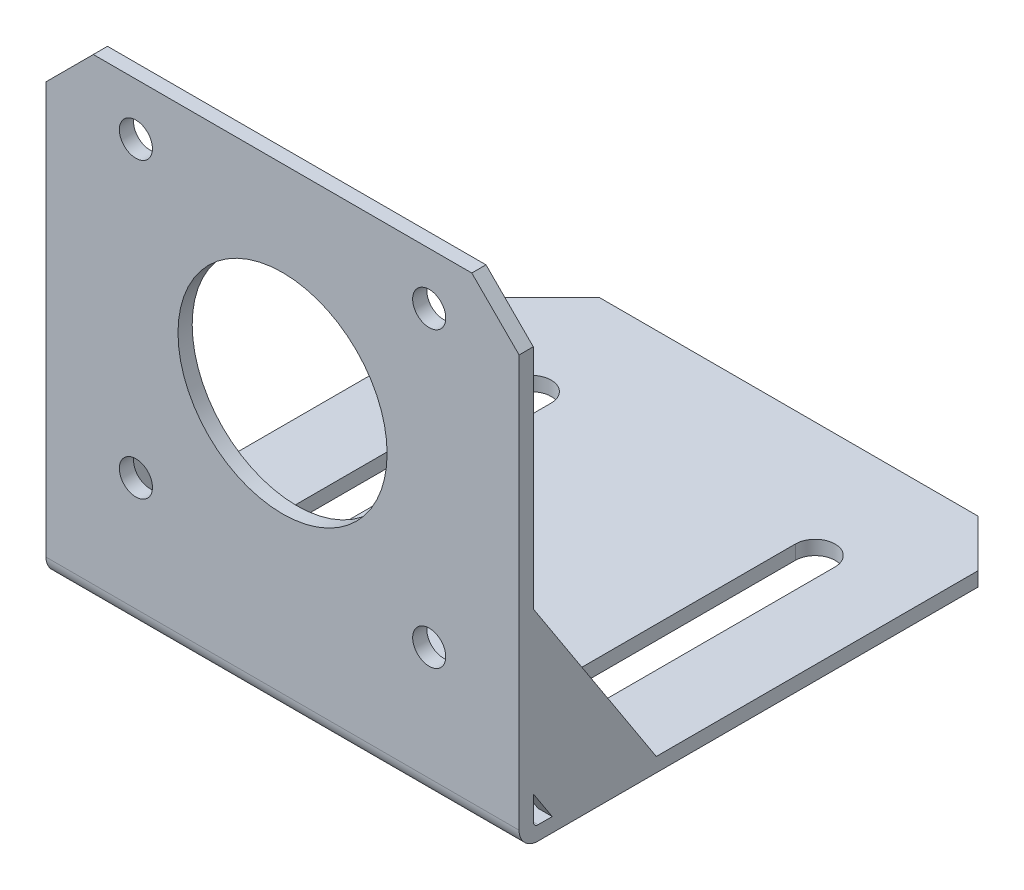
ISO-10303-21;
HEADER;
FILE_DESCRIPTION(('STEP AP214'),'2;1');
FILE_NAME('part.step','',(''),(''),'','','');
FILE_SCHEMA(('AUTOMOTIVE_DESIGN { 1 0 10303 214 1 1 1 1 }'));
ENDSEC;
DATA;
#1=APPLICATION_CONTEXT('core data for automotive mechanical design processes');
#2=APPLICATION_PROTOCOL_DEFINITION('international standard','automotive_design',2000,#1);
#3=PRODUCT_CONTEXT('',#1,'mechanical');
#4=PRODUCT('Part','Part','',(#3));
#5=PRODUCT_RELATED_PRODUCT_CATEGORY('part','',(#4));
#6=PRODUCT_DEFINITION_FORMATION('','',#4);
#7=PRODUCT_DEFINITION_CONTEXT('part definition',#1,'design');
#8=PRODUCT_DEFINITION('design','',#6,#7);
#9=PRODUCT_DEFINITION_SHAPE('','',#8);
#10=(LENGTH_UNIT() NAMED_UNIT(*) SI_UNIT(.MILLI.,.METRE.));
#11=(NAMED_UNIT(*) PLANE_ANGLE_UNIT() SI_UNIT($,.RADIAN.));
#12=(NAMED_UNIT(*) SI_UNIT($,.STERADIAN.) SOLID_ANGLE_UNIT());
#13=UNCERTAINTY_MEASURE_WITH_UNIT(LENGTH_MEASURE(1.E-05),#10,'distance_accuracy_value','');
#14=(GEOMETRIC_REPRESENTATION_CONTEXT(3) GLOBAL_UNCERTAINTY_ASSIGNED_CONTEXT((#13)) GLOBAL_UNIT_ASSIGNED_CONTEXT((#10,
#11,#12)) REPRESENTATION_CONTEXT('',''));
#15=CARTESIAN_POINT('',(0.,0.,0.));
#16=DIRECTION('',(0.,0.,1.));
#17=DIRECTION('',(1.,0.,0.));
#18=AXIS2_PLACEMENT_3D('',#15,#16,#17);
#19=CARTESIAN_POINT('',(50.,1.5,-2.00000000000001));
#20=DIRECTION('',(0.,1.,0.));
#21=DIRECTION('',(0.,0.,1.));
#22=AXIS2_PLACEMENT_3D('',#19,#20,#21);
#23=PLANE('',#22);
#24=CARTESIAN_POINT('',(40.,1.5,-13.7066664875901));
#25=DIRECTION('',(0.,1.,0.));
#26=DIRECTION('',(0.,0.,-1.));
#27=AXIS2_PLACEMENT_3D('',#24,#25,#26);
#28=CIRCLE('',#27,2.1);
#29=CARTESIAN_POINT('',(37.9,1.5,-13.7066664875901));
#30=VERTEX_POINT('',#29);
#31=CARTESIAN_POINT('',(42.1,1.5,-13.7066664875901));
#32=VERTEX_POINT('',#31);
#33=EDGE_CURVE('E224',#30,#32,#28,.T.);
#34=ORIENTED_EDGE('',*,*,#33,.F.);
#35=DIRECTION('',(0.,0.,1.));
#36=VECTOR('',#35,1.);
#37=CARTESIAN_POINT('',(37.9,1.5,-13.7066664875901));
#38=LINE('',#37,#36);
#39=CARTESIAN_POINT('',(37.9,1.5,-41.2933335124099));
#40=VERTEX_POINT('',#39);
#41=EDGE_CURVE('E242',#40,#30,#38,.T.);
#42=ORIENTED_EDGE('',*,*,#41,.F.);
#43=CARTESIAN_POINT('',(40.,1.5,-41.2933335124099));
#44=DIRECTION('',(0.,1.,0.));
#45=DIRECTION('',(0.,0.,-1.));
#46=AXIS2_PLACEMENT_3D('',#43,#44,#45);
#47=CIRCLE('',#46,2.09999999999998);
#48=CARTESIAN_POINT('',(42.1,1.5,-41.2933335124099));
#49=VERTEX_POINT('',#48);
#50=EDGE_CURVE('E245',#49,#40,#47,.T.);
#51=ORIENTED_EDGE('',*,*,#50,.F.);
#52=DIRECTION('',(0.,0.,-1.));
#53=VECTOR('',#52,1.);
#54=CARTESIAN_POINT('',(42.1,1.5,-13.7066664875901));
#55=LINE('',#54,#53);
#56=EDGE_CURVE('E251',#32,#49,#55,.T.);
#57=ORIENTED_EDGE('',*,*,#56,.F.);
#58=EDGE_LOOP('',(#34,#42,#51,#57));
#59=FACE_BOUND('',#58,.T.);
#60=CARTESIAN_POINT('',(10.,1.5,-13.7066664875901));
#61=DIRECTION('',(0.,1.,0.));
#62=DIRECTION('',(0.,0.,1.));
#63=AXIS2_PLACEMENT_3D('',#60,#61,#62);
#64=CIRCLE('',#63,2.10000000000001);
#65=CARTESIAN_POINT('',(7.9,1.5,-13.7066664875901));
#66=VERTEX_POINT('',#65);
#67=CARTESIAN_POINT('',(12.1,1.5,-13.7066664875901));
#68=VERTEX_POINT('',#67);
#69=EDGE_CURVE('E257',#66,#68,#64,.T.);
#70=ORIENTED_EDGE('',*,*,#69,.F.);
#71=DIRECTION('',(0.,0.,1.));
#72=VECTOR('',#71,1.);
#73=CARTESIAN_POINT('',(7.9,1.5,-13.7066664875901));
#74=LINE('',#73,#72);
#75=CARTESIAN_POINT('',(7.90000000000001,1.5,-41.2933335124099));
#76=VERTEX_POINT('',#75);
#77=EDGE_CURVE('E265',#76,#66,#74,.T.);
#78=ORIENTED_EDGE('',*,*,#77,.F.);
#79=CARTESIAN_POINT('',(10.,1.5,-41.2933335124099));
#80=DIRECTION('',(0.,1.,0.));
#81=DIRECTION('',(0.,0.,1.));
#82=AXIS2_PLACEMENT_3D('',#79,#80,#81);
#83=CIRCLE('',#82,2.09999999999999);
#84=CARTESIAN_POINT('',(12.1,1.5,-41.2933335124099));
#85=VERTEX_POINT('',#84);
#86=EDGE_CURVE('E279',#85,#76,#83,.T.);
#87=ORIENTED_EDGE('',*,*,#86,.F.);
#88=DIRECTION('',(0.,0.,-1.));
#89=VECTOR('',#88,1.);
#90=CARTESIAN_POINT('',(12.1,1.5,-13.7066664875901));
#91=LINE('',#90,#89);
#92=EDGE_CURVE('E276',#68,#85,#91,.T.);
#93=ORIENTED_EDGE('',*,*,#92,.F.);
#94=EDGE_LOOP('',(#70,#78,#87,#93));
#95=FACE_BOUND('',#94,.T.);
#96=DIRECTION('',(-1.,0.,0.));
#97=VECTOR('',#96,1.);
#98=CARTESIAN_POINT('',(50.,1.5,-53.5));
#99=LINE('',#98,#97);
#100=CARTESIAN_POINT('',(45.,1.5,-53.5));
#101=VERTEX_POINT('',#100);
#102=CARTESIAN_POINT('',(5.00000000000003,1.5,-53.5));
#103=VERTEX_POINT('',#102);
#104=EDGE_CURVE('E425',#101,#103,#99,.T.);
#105=ORIENTED_EDGE('',*,*,#104,.T.);
#106=DIRECTION('',(-0.707106781186549,0.,0.707106781186547));
#107=VECTOR('',#106,1.);
#108=CARTESIAN_POINT('',(1.75000000000008,1.5,-50.2500000000001));
#109=LINE('',#108,#107);
#110=CARTESIAN_POINT('',(0.,1.5,-48.5));
#111=VERTEX_POINT('',#110);
#112=EDGE_CURVE('E11',#103,#111,#109,.T.);
#113=ORIENTED_EDGE('',*,*,#112,.T.);
#114=DIRECTION('',(0.,0.,-1.));
#115=VECTOR('',#114,1.);
#116=CARTESIAN_POINT('',(0.,1.5,-2.00000000000001));
#117=LINE('',#116,#115);
#118=CARTESIAN_POINT('',(0.,1.5,-14.5));
#119=VERTEX_POINT('',#118);
#120=EDGE_CURVE('E396',#119,#111,#117,.T.);
#121=ORIENTED_EDGE('',*,*,#120,.F.);
#122=DIRECTION('',(-1.,0.,0.));
#123=VECTOR('',#122,1.);
#124=CARTESIAN_POINT('',(1.5,1.5,-14.5));
#125=LINE('',#124,#123);
#126=CARTESIAN_POINT('',(1.5,1.5,-14.5));
#127=VERTEX_POINT('',#126);
#128=EDGE_CURVE('E313',#127,#119,#125,.T.);
#129=ORIENTED_EDGE('',*,*,#128,.F.);
#130=DIRECTION('',(0.,0.,-1.));
#131=VECTOR('',#130,1.);
#132=CARTESIAN_POINT('',(1.5,1.5,-3.5));
#133=LINE('',#132,#131);
#134=CARTESIAN_POINT('',(1.5,1.5,-3.5));
#135=VERTEX_POINT('',#134);
#136=EDGE_CURVE('E299',#135,#127,#133,.T.);
#137=ORIENTED_EDGE('',*,*,#136,.F.);
#138=DIRECTION('',(-1.,0.,0.));
#139=VECTOR('',#138,1.);
#140=CARTESIAN_POINT('',(1.5,1.5,-3.5));
#141=LINE('',#140,#139);
#142=CARTESIAN_POINT('',(0.,1.5,-3.5));
#143=VERTEX_POINT('',#142);
#144=EDGE_CURVE('E310',#135,#143,#141,.T.);
#145=ORIENTED_EDGE('',*,*,#144,.T.);
#146=CARTESIAN_POINT('',(0.,1.5,-2.00000000000001));
#147=VERTEX_POINT('',#146);
#148=EDGE_CURVE('E397',#147,#143,#117,.T.);
#149=ORIENTED_EDGE('',*,*,#148,.F.);
#150=DIRECTION('',(-1.,0.,0.));
#151=VECTOR('',#150,1.);
#152=CARTESIAN_POINT('',(50.,1.5,-2.00000000000001));
#153=LINE('',#152,#151);
#154=CARTESIAN_POINT('',(50.,1.5,-2.00000000000001));
#155=VERTEX_POINT('',#154);
#156=EDGE_CURVE('E423',#155,#147,#153,.T.);
#157=ORIENTED_EDGE('',*,*,#156,.F.);
#158=DIRECTION('',(0.,0.,-1.));
#159=VECTOR('',#158,1.);
#160=CARTESIAN_POINT('',(50.,1.5,-2.00000000000001));
#161=LINE('',#160,#159);
#162=CARTESIAN_POINT('',(50.,1.5,-3.5));
#163=VERTEX_POINT('',#162);
#164=EDGE_CURVE('E381',#155,#163,#161,.T.);
#165=ORIENTED_EDGE('',*,*,#164,.T.);
#166=DIRECTION('',(1.,0.,0.));
#167=VECTOR('',#166,1.);
#168=CARTESIAN_POINT('',(48.5,1.5,-3.5));
#169=LINE('',#168,#167);
#170=CARTESIAN_POINT('',(48.5,1.5,-3.5));
#171=VERTEX_POINT('',#170);
#172=EDGE_CURVE('E341',#171,#163,#169,.T.);
#173=ORIENTED_EDGE('',*,*,#172,.F.);
#174=DIRECTION('',(0.,0.,-1.));
#175=VECTOR('',#174,1.);
#176=CARTESIAN_POINT('',(48.5,1.5,-3.5));
#177=LINE('',#176,#175);
#178=CARTESIAN_POINT('',(48.5,1.5,-14.5));
#179=VERTEX_POINT('',#178);
#180=EDGE_CURVE('E324',#171,#179,#177,.T.);
#181=ORIENTED_EDGE('',*,*,#180,.T.);
#182=DIRECTION('',(1.,0.,0.));
#183=VECTOR('',#182,1.);
#184=CARTESIAN_POINT('',(48.5,1.5,-14.5));
#185=LINE('',#184,#183);
#186=CARTESIAN_POINT('',(50.,1.5,-14.5));
#187=VERTEX_POINT('',#186);
#188=EDGE_CURVE('E338',#179,#187,#185,.T.);
#189=ORIENTED_EDGE('',*,*,#188,.T.);
#190=CARTESIAN_POINT('',(50.,1.5,-48.5));
#191=VERTEX_POINT('',#190);
#192=EDGE_CURVE('E379',#187,#191,#161,.T.);
#193=ORIENTED_EDGE('',*,*,#192,.T.);
#194=DIRECTION('',(0.707106781186547,0.,0.707106781186549));
#195=VECTOR('',#194,1.);
#196=CARTESIAN_POINT('',(73.25,1.5,-25.2499999999999));
#197=LINE('',#196,#195);
#198=EDGE_CURVE('E40',#191,#101,#197,.F.);
#199=ORIENTED_EDGE('',*,*,#198,.T.);
#200=EDGE_LOOP('',(#105,#113,#121,#129,#137,#145,#149,#157,#165,#173,#181,#189,#193,#199));
#201=FACE_BOUND('',#200,.T.);
#202=ADVANCED_FACE('F32',(#59,#95,#201),#23,.T.);
#203=CARTESIAN_POINT('',(50.,2.00000000000001,-1.5));
#204=DIRECTION('',(0.,0.,-1.));
#205=DIRECTION('',(-1.,0.,0.));
#206=AXIS2_PLACEMENT_3D('',#203,#204,#205);
#207=PLANE('',#206);
#208=CARTESIAN_POINT('',(25.,29.5,-1.5));
#209=DIRECTION('',(0.,0.,-1.));
#210=DIRECTION('',(-1.,0.,0.));
#211=AXIS2_PLACEMENT_3D('',#208,#209,#210);
#212=CIRCLE('',#211,11.05);
#213=CARTESIAN_POINT('',(13.95,29.5,-1.5));
#214=VERTEX_POINT('',#213);
#215=EDGE_CURVE('E367',#214,#214,#212,.T.);
#216=ORIENTED_EDGE('',*,*,#215,.F.);
#217=EDGE_LOOP('',(#216));
#218=FACE_BOUND('',#217,.T.);
#219=CARTESIAN_POINT('',(40.5,45.,-1.5));
#220=DIRECTION('',(0.,0.,-1.));
#221=DIRECTION('',(-1.,0.,0.));
#222=AXIS2_PLACEMENT_3D('',#219,#220,#221);
#223=CIRCLE('',#222,1.75);
#224=CARTESIAN_POINT('',(38.75,45.,-1.5));
#225=VERTEX_POINT('',#224);
#226=EDGE_CURVE('E361',#225,#225,#223,.T.);
#227=ORIENTED_EDGE('',*,*,#226,.F.);
#228=EDGE_LOOP('',(#227));
#229=FACE_BOUND('',#228,.T.);
#230=CARTESIAN_POINT('',(9.49999999999999,45.,-1.5));
#231=DIRECTION('',(0.,0.,-1.));
#232=DIRECTION('',(-1.,0.,0.));
#233=AXIS2_PLACEMENT_3D('',#230,#231,#232);
#234=CIRCLE('',#233,1.75);
#235=CARTESIAN_POINT('',(7.74999999999999,45.,-1.5));
#236=VERTEX_POINT('',#235);
#237=EDGE_CURVE('E355',#236,#236,#234,.T.);
#238=ORIENTED_EDGE('',*,*,#237,.F.);
#239=EDGE_LOOP('',(#238));
#240=FACE_BOUND('',#239,.T.);
#241=CARTESIAN_POINT('',(9.5,14.,-1.5));
#242=DIRECTION('',(0.,0.,-1.));
#243=DIRECTION('',(-1.,0.,0.));
#244=AXIS2_PLACEMENT_3D('',#241,#242,#243);
#245=CIRCLE('',#244,1.75000000000001);
#246=CARTESIAN_POINT('',(7.74999999999999,14.,-1.5));
#247=VERTEX_POINT('',#246);
#248=EDGE_CURVE('E349',#247,#247,#245,.T.);
#249=ORIENTED_EDGE('',*,*,#248,.F.);
#250=EDGE_LOOP('',(#249));
#251=FACE_BOUND('',#250,.T.);
#252=CARTESIAN_POINT('',(40.5,14.,-1.5));
#253=DIRECTION('',(0.,0.,-1.));
#254=DIRECTION('',(-1.,0.,0.));
#255=AXIS2_PLACEMENT_3D('',#252,#253,#254);
#256=CIRCLE('',#255,1.75000000000001);
#257=CARTESIAN_POINT('',(38.75,14.,-1.5));
#258=VERTEX_POINT('',#257);
#259=EDGE_CURVE('E337',#258,#258,#256,.T.);
#260=ORIENTED_EDGE('',*,*,#259,.F.);
#261=EDGE_LOOP('',(#260));
#262=FACE_BOUND('',#261,.T.);
#263=DIRECTION('',(-1.,0.,0.));
#264=VECTOR('',#263,1.);
#265=CARTESIAN_POINT('',(50.,50.5,-1.5));
#266=LINE('',#265,#264);
#267=CARTESIAN_POINT('',(45.,50.5,-1.5));
#268=VERTEX_POINT('',#267);
#269=CARTESIAN_POINT('',(5.00000000000003,50.5,-1.5));
#270=VERTEX_POINT('',#269);
#271=EDGE_CURVE('E417',#268,#270,#266,.T.);
#272=ORIENTED_EDGE('',*,*,#271,.F.);
#273=DIRECTION('',(-0.707106781186547,0.707106781186549,0.));
#274=VECTOR('',#273,1.);
#275=CARTESIAN_POINT('',(71.75,23.7499999999999,-1.5));
#276=LINE('',#275,#274);
#277=CARTESIAN_POINT('',(50.,45.5,-1.5));
#278=VERTEX_POINT('',#277);
#279=EDGE_CURVE('E436',#268,#278,#276,.F.);
#280=ORIENTED_EDGE('',*,*,#279,.T.);
#281=DIRECTION('',(0.,1.,0.));
#282=VECTOR('',#281,1.);
#283=CARTESIAN_POINT('',(50.,2.00000000000001,-1.5));
#284=LINE('',#283,#282);
#285=CARTESIAN_POINT('',(50.,21.5,-1.5));
#286=VERTEX_POINT('',#285);
#287=EDGE_CURVE('E387',#278,#286,#284,.F.);
#288=ORIENTED_EDGE('',*,*,#287,.T.);
#289=DIRECTION('',(1.,0.,0.));
#290=VECTOR('',#289,1.);
#291=CARTESIAN_POINT('',(48.5,21.5,-1.5));
#292=LINE('',#291,#290);
#293=CARTESIAN_POINT('',(48.5,21.5,-1.5));
#294=VERTEX_POINT('',#293);
#295=EDGE_CURVE('E334',#294,#286,#292,.T.);
#296=ORIENTED_EDGE('',*,*,#295,.F.);
#297=DIRECTION('',(0.,-1.,0.));
#298=VECTOR('',#297,1.);
#299=CARTESIAN_POINT('',(48.5,21.5,-1.5));
#300=LINE('',#299,#298);
#301=CARTESIAN_POINT('',(48.5,4.57692307692308,-1.5));
#302=VERTEX_POINT('',#301);
#303=EDGE_CURVE('E318',#294,#302,#300,.T.);
#304=ORIENTED_EDGE('',*,*,#303,.T.);
#305=DIRECTION('',(1.,0.,0.));
#306=VECTOR('',#305,1.);
#307=CARTESIAN_POINT('',(48.5,4.57692307692308,-1.5));
#308=LINE('',#307,#306);
#309=CARTESIAN_POINT('',(50.,4.57692307692308,-1.5));
#310=VERTEX_POINT('',#309);
#311=EDGE_CURVE('E329',#302,#310,#308,.T.);
#312=ORIENTED_EDGE('',*,*,#311,.T.);
#313=CARTESIAN_POINT('',(50.,2.,-1.5));
#314=VERTEX_POINT('',#313);
#315=EDGE_CURVE('E386',#310,#314,#284,.F.);
#316=ORIENTED_EDGE('',*,*,#315,.T.);
#317=DIRECTION('',(-1.,0.,0.));
#318=VECTOR('',#317,1.);
#319=CARTESIAN_POINT('',(50.,2.,-1.5));
#320=LINE('',#319,#318);
#321=CARTESIAN_POINT('',(0.,2.,-1.5));
#322=VERTEX_POINT('',#321);
#323=EDGE_CURVE('E420',#314,#322,#320,.T.);
#324=ORIENTED_EDGE('',*,*,#323,.T.);
#325=DIRECTION('',(0.,1.,0.));
#326=VECTOR('',#325,1.);
#327=CARTESIAN_POINT('',(0.,2.00000000000001,-1.5));
#328=LINE('',#327,#326);
#329=CARTESIAN_POINT('',(0.,4.57692307692308,-1.5));
#330=VERTEX_POINT('',#329);
#331=EDGE_CURVE('E403',#330,#322,#328,.F.);
#332=ORIENTED_EDGE('',*,*,#331,.F.);
#333=DIRECTION('',(-1.,0.,0.));
#334=VECTOR('',#333,1.);
#335=CARTESIAN_POINT('',(1.5,4.57692307692308,-1.5));
#336=LINE('',#335,#334);
#337=CARTESIAN_POINT('',(1.5,4.57692307692308,-1.5));
#338=VERTEX_POINT('',#337);
#339=EDGE_CURVE('E307',#338,#330,#336,.T.);
#340=ORIENTED_EDGE('',*,*,#339,.F.);
#341=DIRECTION('',(0.,-1.,0.));
#342=VECTOR('',#341,1.);
#343=CARTESIAN_POINT('',(1.5,21.5,-1.5));
#344=LINE('',#343,#342);
#345=CARTESIAN_POINT('',(1.5,21.5,-1.5));
#346=VERTEX_POINT('',#345);
#347=EDGE_CURVE('E293',#346,#338,#344,.T.);
#348=ORIENTED_EDGE('',*,*,#347,.F.);
#349=DIRECTION('',(-1.,0.,0.));
#350=VECTOR('',#349,1.);
#351=CARTESIAN_POINT('',(1.5,21.5,-1.5));
#352=LINE('',#351,#350);
#353=CARTESIAN_POINT('',(0.,21.5,-1.5));
#354=VERTEX_POINT('',#353);
#355=EDGE_CURVE('E303',#346,#354,#352,.T.);
#356=ORIENTED_EDGE('',*,*,#355,.T.);
#357=CARTESIAN_POINT('',(0.,45.5,-1.5));
#358=VERTEX_POINT('',#357);
#359=EDGE_CURVE('E404',#358,#354,#328,.F.);
#360=ORIENTED_EDGE('',*,*,#359,.F.);
#361=DIRECTION('',(0.707106781186549,0.707106781186547,0.));
#362=VECTOR('',#361,1.);
#363=CARTESIAN_POINT('',(3.25000000000009,48.7500000000001,-1.5));
#364=LINE('',#363,#362);
#365=EDGE_CURVE('E434',#358,#270,#364,.T.);
#366=ORIENTED_EDGE('',*,*,#365,.T.);
#367=EDGE_LOOP('',(#272,#280,#288,#296,#304,#312,#316,#324,#332,#340,#348,#356,#360,#366));
#368=FACE_BOUND('',#367,.T.);
#369=ADVANCED_FACE('F532',(#218,#229,#240,#251,#262,#368),#207,.T.);
#370=CARTESIAN_POINT('',(50.,0.,-2.00000000000001));
#371=DIRECTION('',(0.,1.,0.));
#372=DIRECTION('',(0.,0.,1.));
#373=AXIS2_PLACEMENT_3D('',#370,#371,#372);
#374=PLANE('',#373);
#375=DIRECTION('',(0.,0.,1.));
#376=VECTOR('',#375,1.);
#377=CARTESIAN_POINT('',(37.9,0.,-13.7066664875901));
#378=LINE('',#377,#376);
#379=CARTESIAN_POINT('',(37.9,0.,-41.2933335124099));
#380=VERTEX_POINT('',#379);
#381=CARTESIAN_POINT('',(37.9,0.,-13.7066664875901));
#382=VERTEX_POINT('',#381);
#383=EDGE_CURVE('E229',#380,#382,#378,.T.);
#384=ORIENTED_EDGE('',*,*,#383,.T.);
#385=CARTESIAN_POINT('',(40.,0.,-13.7066664875901));
#386=DIRECTION('',(0.,1.,0.));
#387=DIRECTION('',(0.,0.,-1.));
#388=AXIS2_PLACEMENT_3D('',#385,#386,#387);
#389=CIRCLE('',#388,2.1);
#390=CARTESIAN_POINT('',(42.1,0.,-13.7066664875901));
#391=VERTEX_POINT('',#390);
#392=EDGE_CURVE('E221',#382,#391,#389,.T.);
#393=ORIENTED_EDGE('',*,*,#392,.T.);
#394=DIRECTION('',(0.,0.,-1.));
#395=VECTOR('',#394,1.);
#396=CARTESIAN_POINT('',(42.1,0.,-13.7066664875901));
#397=LINE('',#396,#395);
#398=CARTESIAN_POINT('',(42.1,0.,-41.2933335124099));
#399=VERTEX_POINT('',#398);
#400=EDGE_CURVE('E233',#391,#399,#397,.T.);
#401=ORIENTED_EDGE('',*,*,#400,.T.);
#402=CARTESIAN_POINT('',(40.,0.,-41.2933335124099));
#403=DIRECTION('',(0.,1.,0.));
#404=DIRECTION('',(0.,0.,-1.));
#405=AXIS2_PLACEMENT_3D('',#402,#403,#404);
#406=CIRCLE('',#405,2.09999999999998);
#407=EDGE_CURVE('E237',#399,#380,#406,.T.);
#408=ORIENTED_EDGE('',*,*,#407,.T.);
#409=EDGE_LOOP('',(#384,#393,#401,#408));
#410=FACE_BOUND('',#409,.T.);
#411=DIRECTION('',(0.,0.,1.));
#412=VECTOR('',#411,1.);
#413=CARTESIAN_POINT('',(7.9,0.,-13.7066664875901));
#414=LINE('',#413,#412);
#415=CARTESIAN_POINT('',(7.90000000000001,0.,-41.2933335124099));
#416=VERTEX_POINT('',#415);
#417=CARTESIAN_POINT('',(7.9,0.,-13.7066664875901));
#418=VERTEX_POINT('',#417);
#419=EDGE_CURVE('E271',#416,#418,#414,.T.);
#420=ORIENTED_EDGE('',*,*,#419,.T.);
#421=CARTESIAN_POINT('',(10.,0.,-13.7066664875901));
#422=DIRECTION('',(0.,1.,0.));
#423=DIRECTION('',(0.,0.,1.));
#424=AXIS2_PLACEMENT_3D('',#421,#422,#423);
#425=CIRCLE('',#424,2.10000000000001);
#426=CARTESIAN_POINT('',(12.1,0.,-13.7066664875901));
#427=VERTEX_POINT('',#426);
#428=EDGE_CURVE('E261',#418,#427,#425,.T.);
#429=ORIENTED_EDGE('',*,*,#428,.T.);
#430=DIRECTION('',(0.,0.,-1.));
#431=VECTOR('',#430,1.);
#432=CARTESIAN_POINT('',(12.1,0.,-13.7066664875901));
#433=LINE('',#432,#431);
#434=CARTESIAN_POINT('',(12.1,0.,-41.2933335124099));
#435=VERTEX_POINT('',#434);
#436=EDGE_CURVE('E264',#427,#435,#433,.T.);
#437=ORIENTED_EDGE('',*,*,#436,.T.);
#438=CARTESIAN_POINT('',(10.,0.,-41.2933335124099));
#439=DIRECTION('',(0.,1.,0.));
#440=DIRECTION('',(0.,0.,1.));
#441=AXIS2_PLACEMENT_3D('',#438,#439,#440);
#442=CIRCLE('',#441,2.09999999999999);
#443=EDGE_CURVE('E268',#435,#416,#442,.T.);
#444=ORIENTED_EDGE('',*,*,#443,.T.);
#445=EDGE_LOOP('',(#420,#429,#437,#444));
#446=FACE_BOUND('',#445,.T.);
#447=DIRECTION('',(0.,0.,-1.));
#448=VECTOR('',#447,1.);
#449=CARTESIAN_POINT('',(0.,0.,-2.00000000000001));
#450=LINE('',#449,#448);
#451=CARTESIAN_POINT('',(0.,0.,-2.00000000000001));
#452=VERTEX_POINT('',#451);
#453=CARTESIAN_POINT('',(0.,0.,-48.5));
#454=VERTEX_POINT('',#453);
#455=EDGE_CURVE('E373',#452,#454,#450,.T.);
#456=ORIENTED_EDGE('',*,*,#455,.T.);
#457=DIRECTION('',(0.707106781186549,0.,-0.707106781186547));
#458=VECTOR('',#457,1.);
#459=CARTESIAN_POINT('',(0.,0.,-48.5));
#460=LINE('',#459,#458);
#461=CARTESIAN_POINT('',(5.00000000000002,0.,-53.5));
#462=VERTEX_POINT('',#461);
#463=EDGE_CURVE('E454',#454,#462,#460,.T.);
#464=ORIENTED_EDGE('',*,*,#463,.T.);
#465=DIRECTION('',(-1.,0.,0.));
#466=VECTOR('',#465,1.);
#467=CARTESIAN_POINT('',(50.,0.,-53.5));
#468=LINE('',#467,#466);
#469=CARTESIAN_POINT('',(45.,0.,-53.5));
#470=VERTEX_POINT('',#469);
#471=EDGE_CURVE('E427',#470,#462,#468,.T.);
#472=ORIENTED_EDGE('',*,*,#471,.F.);
#473=DIRECTION('',(-0.707106781186547,0.,-0.707106781186549));
#474=VECTOR('',#473,1.);
#475=CARTESIAN_POINT('',(45.,0.,-53.5));
#476=LINE('',#475,#474);
#477=CARTESIAN_POINT('',(50.,0.,-48.5));
#478=VERTEX_POINT('',#477);
#479=EDGE_CURVE('E452',#470,#478,#476,.F.);
#480=ORIENTED_EDGE('',*,*,#479,.T.);
#481=DIRECTION('',(0.,0.,-1.));
#482=VECTOR('',#481,1.);
#483=CARTESIAN_POINT('',(50.,0.,-2.00000000000001));
#484=LINE('',#483,#482);
#485=CARTESIAN_POINT('',(50.,0.,-2.00000000000001));
#486=VERTEX_POINT('',#485);
#487=EDGE_CURVE('E376',#486,#478,#484,.T.);
#488=ORIENTED_EDGE('',*,*,#487,.F.);
#489=DIRECTION('',(-1.,0.,0.));
#490=VECTOR('',#489,1.);
#491=CARTESIAN_POINT('',(50.,0.,-2.00000000000001));
#492=LINE('',#491,#490);
#493=EDGE_CURVE('E393',#486,#452,#492,.T.);
#494=ORIENTED_EDGE('',*,*,#493,.T.);
#495=EDGE_LOOP('',(#456,#464,#472,#480,#488,#494));
#496=FACE_BOUND('',#495,.T.);
#497=ADVANCED_FACE('F239',(#410,#446,#496),#374,.F.);
#498=CARTESIAN_POINT('',(50.,1.5,-53.5));
#499=DIRECTION('',(0.,0.,-1.));
#500=DIRECTION('',(-1.,0.,0.));
#501=AXIS2_PLACEMENT_3D('',#498,#499,#500);
#502=PLANE('',#501);
#503=ORIENTED_EDGE('',*,*,#471,.T.);
#504=DIRECTION('',(0.,1.,0.));
#505=VECTOR('',#504,1.);
#506=CARTESIAN_POINT('',(5.00000000000002,1.5,-53.5));
#507=LINE('',#506,#505);
#508=EDGE_CURVE('E47',#462,#103,#507,.T.);
#509=ORIENTED_EDGE('',*,*,#508,.T.);
#510=ORIENTED_EDGE('',*,*,#104,.F.);
#511=DIRECTION('',(0.,-1.,0.));
#512=VECTOR('',#511,1.);
#513=CARTESIAN_POINT('',(45.,1.5,-53.5));
#514=LINE('',#513,#512);
#515=EDGE_CURVE('E456',#101,#470,#514,.T.);
#516=ORIENTED_EDGE('',*,*,#515,.T.);
#517=EDGE_LOOP('',(#503,#509,#510,#516));
#518=FACE_BOUND('',#517,.T.);
#519=ADVANCED_FACE('F461',(#518),#502,.T.);
#520=CARTESIAN_POINT('',(50.,2.,-2.));
#521=DIRECTION('',(-1.,0.,0.));
#522=DIRECTION('',(0.,0.,1.));
#523=AXIS2_PLACEMENT_3D('',#520,#521,#522);
#524=CYLINDRICAL_SURFACE('',#523,0.5);
#525=CARTESIAN_POINT('',(0.,2.,-2.));
#526=DIRECTION('',(1.,0.,0.));
#527=DIRECTION('',(0.,0.,-1.));
#528=AXIS2_PLACEMENT_3D('',#525,#526,#527);
#529=CIRCLE('',#528,0.5);
#530=EDGE_CURVE('E400',#322,#147,#529,.T.);
#531=ORIENTED_EDGE('',*,*,#530,.F.);
#532=ORIENTED_EDGE('',*,*,#323,.F.);
#533=CARTESIAN_POINT('',(50.,2.,-2.));
#534=DIRECTION('',(1.,0.,0.));
#535=DIRECTION('',(0.,0.,-1.));
#536=AXIS2_PLACEMENT_3D('',#533,#534,#535);
#537=CIRCLE('',#536,0.5);
#538=EDGE_CURVE('E383',#314,#155,#537,.T.);
#539=ORIENTED_EDGE('',*,*,#538,.T.);
#540=ORIENTED_EDGE('',*,*,#156,.T.);
#541=EDGE_LOOP('',(#531,#532,#539,#540));
#542=FACE_BOUND('',#541,.T.);
#543=ADVANCED_FACE('F496',(#542),#524,.F.);
#544=CARTESIAN_POINT('',(50.,50.5,0.));
#545=DIRECTION('',(0.,1.,0.));
#546=DIRECTION('',(0.,0.,1.));
#547=AXIS2_PLACEMENT_3D('',#544,#545,#546);
#548=PLANE('',#547);
#549=DIRECTION('',(-1.,0.,0.));
#550=VECTOR('',#549,1.);
#551=CARTESIAN_POINT('',(50.,50.5,0.));
#552=LINE('',#551,#550);
#553=CARTESIAN_POINT('',(45.,50.5,0.));
#554=VERTEX_POINT('',#553);
#555=CARTESIAN_POINT('',(5.00000000000005,50.5,0.));
#556=VERTEX_POINT('',#555);
#557=EDGE_CURVE('E414',#554,#556,#552,.T.);
#558=ORIENTED_EDGE('',*,*,#557,.F.);
#559=DIRECTION('',(0.,0.,-1.));
#560=VECTOR('',#559,1.);
#561=CARTESIAN_POINT('',(45.,50.5,0.));
#562=LINE('',#561,#560);
#563=EDGE_CURVE('E431',#554,#268,#562,.T.);
#564=ORIENTED_EDGE('',*,*,#563,.T.);
#565=ORIENTED_EDGE('',*,*,#271,.T.);
#566=DIRECTION('',(0.,0.,1.));
#567=VECTOR('',#566,1.);
#568=CARTESIAN_POINT('',(5.00000000000003,50.5,0.));
#569=LINE('',#568,#567);
#570=EDGE_CURVE('E429',#270,#556,#569,.T.);
#571=ORIENTED_EDGE('',*,*,#570,.T.);
#572=EDGE_LOOP('',(#558,#564,#565,#571));
#573=FACE_BOUND('',#572,.T.);
#574=ADVANCED_FACE('F535',(#573),#548,.T.);
#575=CARTESIAN_POINT('',(50.,2.00000000000001,0.));
#576=DIRECTION('',(0.,0.,-1.));
#577=DIRECTION('',(-1.,0.,0.));
#578=AXIS2_PLACEMENT_3D('',#575,#576,#577);
#579=PLANE('',#578);
#580=CARTESIAN_POINT('',(40.5,14.,0.));
#581=DIRECTION('',(0.,0.,-1.));
#582=DIRECTION('',(-1.,0.,0.));
#583=AXIS2_PLACEMENT_3D('',#580,#581,#582);
#584=CIRCLE('',#583,1.75000000000001);
#585=CARTESIAN_POINT('',(38.75,14.,0.));
#586=VERTEX_POINT('',#585);
#587=EDGE_CURVE('E346',#586,#586,#584,.T.);
#588=ORIENTED_EDGE('',*,*,#587,.T.);
#589=EDGE_LOOP('',(#588));
#590=FACE_BOUND('',#589,.T.);
#591=CARTESIAN_POINT('',(9.5,14.,0.));
#592=DIRECTION('',(0.,0.,-1.));
#593=DIRECTION('',(-1.,0.,0.));
#594=AXIS2_PLACEMENT_3D('',#591,#592,#593);
#595=CIRCLE('',#594,1.75000000000001);
#596=CARTESIAN_POINT('',(7.74999999999999,14.,0.));
#597=VERTEX_POINT('',#596);
#598=EDGE_CURVE('E352',#597,#597,#595,.T.);
#599=ORIENTED_EDGE('',*,*,#598,.T.);
#600=EDGE_LOOP('',(#599));
#601=FACE_BOUND('',#600,.T.);
#602=CARTESIAN_POINT('',(9.49999999999999,45.,0.));
#603=DIRECTION('',(0.,0.,-1.));
#604=DIRECTION('',(-1.,0.,0.));
#605=AXIS2_PLACEMENT_3D('',#602,#603,#604);
#606=CIRCLE('',#605,1.75);
#607=CARTESIAN_POINT('',(7.74999999999999,45.,0.));
#608=VERTEX_POINT('',#607);
#609=EDGE_CURVE('E358',#608,#608,#606,.T.);
#610=ORIENTED_EDGE('',*,*,#609,.T.);
#611=EDGE_LOOP('',(#610));
#612=FACE_BOUND('',#611,.T.);
#613=CARTESIAN_POINT('',(40.5,45.,0.));
#614=DIRECTION('',(0.,0.,-1.));
#615=DIRECTION('',(-1.,0.,0.));
#616=AXIS2_PLACEMENT_3D('',#613,#614,#615);
#617=CIRCLE('',#616,1.75);
#618=CARTESIAN_POINT('',(38.75,45.,0.));
#619=VERTEX_POINT('',#618);
#620=EDGE_CURVE('E364',#619,#619,#617,.T.);
#621=ORIENTED_EDGE('',*,*,#620,.T.);
#622=EDGE_LOOP('',(#621));
#623=FACE_BOUND('',#622,.T.);
#624=CARTESIAN_POINT('',(25.,29.5,0.));
#625=DIRECTION('',(0.,0.,-1.));
#626=DIRECTION('',(-1.,0.,0.));
#627=AXIS2_PLACEMENT_3D('',#624,#625,#626);
#628=CIRCLE('',#627,11.05);
#629=CARTESIAN_POINT('',(13.95,29.5,0.));
#630=VERTEX_POINT('',#629);
#631=EDGE_CURVE('E370',#630,#630,#628,.T.);
#632=ORIENTED_EDGE('',*,*,#631,.T.);
#633=EDGE_LOOP('',(#632));
#634=FACE_BOUND('',#633,.T.);
#635=DIRECTION('',(0.,-1.,0.));
#636=VECTOR('',#635,1.);
#637=CARTESIAN_POINT('',(50.,2.00000000000001,0.));
#638=LINE('',#637,#636);
#639=CARTESIAN_POINT('',(50.,45.5,0.));
#640=VERTEX_POINT('',#639);
#641=CARTESIAN_POINT('',(50.,2.00000000000001,0.));
#642=VERTEX_POINT('',#641);
#643=EDGE_CURVE('E389',#640,#642,#638,.T.);
#644=ORIENTED_EDGE('',*,*,#643,.F.);
#645=DIRECTION('',(0.707106781186547,-0.707106781186549,0.));
#646=VECTOR('',#645,1.);
#647=CARTESIAN_POINT('',(45.,50.5,0.));
#648=LINE('',#647,#646);
#649=EDGE_CURVE('E444',#640,#554,#648,.F.);
#650=ORIENTED_EDGE('',*,*,#649,.T.);
#651=ORIENTED_EDGE('',*,*,#557,.T.);
#652=DIRECTION('',(-0.707106781186549,-0.707106781186547,0.));
#653=VECTOR('',#652,1.);
#654=CARTESIAN_POINT('',(0.,45.5,0.));
#655=LINE('',#654,#653);
#656=CARTESIAN_POINT('',(0.,45.5,0.));
#657=VERTEX_POINT('',#656);
#658=EDGE_CURVE('E442',#556,#657,#655,.T.);
#659=ORIENTED_EDGE('',*,*,#658,.T.);
#660=DIRECTION('',(0.,-1.,0.));
#661=VECTOR('',#660,1.);
#662=CARTESIAN_POINT('',(0.,2.00000000000001,0.));
#663=LINE('',#662,#661);
#664=CARTESIAN_POINT('',(0.,2.00000000000001,0.));
#665=VERTEX_POINT('',#664);
#666=EDGE_CURVE('E406',#657,#665,#663,.T.);
#667=ORIENTED_EDGE('',*,*,#666,.T.);
#668=DIRECTION('',(-1.,0.,0.));
#669=VECTOR('',#668,1.);
#670=CARTESIAN_POINT('',(50.,2.00000000000001,0.));
#671=LINE('',#670,#669);
#672=EDGE_CURVE('E411',#642,#665,#671,.T.);
#673=ORIENTED_EDGE('',*,*,#672,.F.);
#674=EDGE_LOOP('',(#644,#650,#651,#659,#667,#673));
#675=FACE_BOUND('',#674,.T.);
#676=ADVANCED_FACE('F542',(#590,#601,#612,#623,#634,#675),#579,.F.);
#677=CARTESIAN_POINT('',(50.,2.,-2.));
#678=DIRECTION('',(-1.,0.,0.));
#679=DIRECTION('',(0.,0.,1.));
#680=AXIS2_PLACEMENT_3D('',#677,#678,#679);
#681=CYLINDRICAL_SURFACE('',#680,2.);
#682=CARTESIAN_POINT('',(0.,2.,-2.));
#683=DIRECTION('',(1.,0.,0.));
#684=DIRECTION('',(0.,0.,-1.));
#685=AXIS2_PLACEMENT_3D('',#682,#683,#684);
#686=CIRCLE('',#685,2.);
#687=EDGE_CURVE('E380',#665,#452,#686,.T.);
#688=ORIENTED_EDGE('',*,*,#687,.T.);
#689=ORIENTED_EDGE('',*,*,#493,.F.);
#690=CARTESIAN_POINT('',(50.,2.,-2.));
#691=DIRECTION('',(1.,0.,0.));
#692=DIRECTION('',(0.,0.,-1.));
#693=AXIS2_PLACEMENT_3D('',#690,#691,#692);
#694=CIRCLE('',#693,2.);
#695=EDGE_CURVE('E391',#642,#486,#694,.T.);
#696=ORIENTED_EDGE('',*,*,#695,.F.);
#697=ORIENTED_EDGE('',*,*,#672,.T.);
#698=EDGE_LOOP('',(#688,#689,#696,#697));
#699=FACE_BOUND('',#698,.T.);
#700=ADVANCED_FACE('F521',(#699),#681,.T.);
#701=CARTESIAN_POINT('',(50.,2.,-2.));
#702=DIRECTION('',(1.,0.,0.));
#703=DIRECTION('',(0.,0.,-1.));
#704=AXIS2_PLACEMENT_3D('',#701,#702,#703);
#705=PLANE('',#704);
#706=ORIENTED_EDGE('',*,*,#315,.F.);
#707=DIRECTION('',(0.,-0.838443616300637,-0.544988350595414));
#708=VECTOR('',#707,1.);
#709=CARTESIAN_POINT('',(50.,4.57692307692308,-1.5));
#710=LINE('',#709,#708);
#711=EDGE_CURVE('E309',#310,#163,#710,.T.);
#712=ORIENTED_EDGE('',*,*,#711,.T.);
#713=ORIENTED_EDGE('',*,*,#164,.F.);
#714=ORIENTED_EDGE('',*,*,#538,.F.);
#715=EDGE_LOOP('',(#706,#712,#713,#714));
#716=FACE_BOUND('',#715,.T.);
#717=ORIENTED_EDGE('',*,*,#287,.F.);
#718=DIRECTION('',(0.,0.,1.));
#719=VECTOR('',#718,1.);
#720=CARTESIAN_POINT('',(50.,45.5,-2.));
#721=LINE('',#720,#719);
#722=EDGE_CURVE('E440',#278,#640,#721,.T.);
#723=ORIENTED_EDGE('',*,*,#722,.T.);
#724=ORIENTED_EDGE('',*,*,#643,.T.);
#725=ORIENTED_EDGE('',*,*,#695,.T.);
#726=ORIENTED_EDGE('',*,*,#487,.T.);
#727=DIRECTION('',(0.,1.,0.));
#728=VECTOR('',#727,1.);
#729=CARTESIAN_POINT('',(50.,2.,-48.5));
#730=LINE('',#729,#728);
#731=EDGE_CURVE('E438',#478,#191,#730,.T.);
#732=ORIENTED_EDGE('',*,*,#731,.T.);
#733=ORIENTED_EDGE('',*,*,#192,.F.);
#734=DIRECTION('',(0.,0.838443616300637,0.544988350595414));
#735=VECTOR('',#734,1.);
#736=CARTESIAN_POINT('',(50.,21.5,-1.5));
#737=LINE('',#736,#735);
#738=EDGE_CURVE('E321',#187,#286,#737,.T.);
#739=ORIENTED_EDGE('',*,*,#738,.T.);
#740=EDGE_LOOP('',(#717,#723,#724,#725,#726,#732,#733,#739));
#741=FACE_BOUND('',#740,.T.);
#742=ADVANCED_FACE('F500',(#716,#741),#705,.T.);
#743=CARTESIAN_POINT('',(0.,2.,-2.));
#744=DIRECTION('',(1.,0.,0.));
#745=DIRECTION('',(0.,0.,-1.));
#746=AXIS2_PLACEMENT_3D('',#743,#744,#745);
#747=PLANE('',#746);
#748=DIRECTION('',(0.,-0.838443616300637,-0.544988350595414));
#749=VECTOR('',#748,1.);
#750=CARTESIAN_POINT('',(0.,4.57692307692308,-1.5));
#751=LINE('',#750,#749);
#752=EDGE_CURVE('E297',#330,#143,#751,.T.);
#753=ORIENTED_EDGE('',*,*,#752,.F.);
#754=ORIENTED_EDGE('',*,*,#331,.T.);
#755=ORIENTED_EDGE('',*,*,#530,.T.);
#756=ORIENTED_EDGE('',*,*,#148,.T.);
#757=EDGE_LOOP('',(#753,#754,#755,#756));
#758=FACE_BOUND('',#757,.T.);
#759=ORIENTED_EDGE('',*,*,#666,.F.);
#760=DIRECTION('',(0.,0.,-1.));
#761=VECTOR('',#760,1.);
#762=CARTESIAN_POINT('',(0.,45.5,-1.5));
#763=LINE('',#762,#761);
#764=EDGE_CURVE('E449',#657,#358,#763,.T.);
#765=ORIENTED_EDGE('',*,*,#764,.T.);
#766=ORIENTED_EDGE('',*,*,#359,.T.);
#767=DIRECTION('',(0.,0.838443616300637,0.544988350595414));
#768=VECTOR('',#767,1.);
#769=CARTESIAN_POINT('',(0.,21.5,-1.5));
#770=LINE('',#769,#768);
#771=EDGE_CURVE('E286',#119,#354,#770,.T.);
#772=ORIENTED_EDGE('',*,*,#771,.F.);
#773=ORIENTED_EDGE('',*,*,#120,.T.);
#774=DIRECTION('',(0.,-1.,0.));
#775=VECTOR('',#774,1.);
#776=CARTESIAN_POINT('',(0.,0.,-48.5));
#777=LINE('',#776,#775);
#778=EDGE_CURVE('E446',#111,#454,#777,.T.);
#779=ORIENTED_EDGE('',*,*,#778,.T.);
#780=ORIENTED_EDGE('',*,*,#455,.F.);
#781=ORIENTED_EDGE('',*,*,#687,.F.);
#782=EDGE_LOOP('',(#759,#765,#766,#772,#773,#779,#780,#781));
#783=FACE_BOUND('',#782,.T.);
#784=ADVANCED_FACE('F473',(#758,#783),#747,.F.);
#785=CARTESIAN_POINT('',(25.,29.5,0.));
#786=DIRECTION('',(0.,0.,-1.));
#787=DIRECTION('',(-1.,0.,0.));
#788=AXIS2_PLACEMENT_3D('',#785,#786,#787);
#789=CYLINDRICAL_SURFACE('',#788,11.05);
#790=ORIENTED_EDGE('',*,*,#631,.F.);
#791=EDGE_LOOP('',(#790));
#792=FACE_BOUND('',#791,.T.);
#793=ORIENTED_EDGE('',*,*,#215,.T.);
#794=EDGE_LOOP('',(#793));
#795=FACE_BOUND('',#794,.T.);
#796=ADVANCED_FACE('F604',(#792,#795),#789,.F.);
#797=CARTESIAN_POINT('',(40.5,45.,0.));
#798=DIRECTION('',(0.,0.,-1.));
#799=DIRECTION('',(-1.,0.,0.));
#800=AXIS2_PLACEMENT_3D('',#797,#798,#799);
#801=CYLINDRICAL_SURFACE('',#800,1.75);
#802=ORIENTED_EDGE('',*,*,#620,.F.);
#803=EDGE_LOOP('',(#802));
#804=FACE_BOUND('',#803,.T.);
#805=ORIENTED_EDGE('',*,*,#226,.T.);
#806=EDGE_LOOP('',(#805));
#807=FACE_BOUND('',#806,.T.);
#808=ADVANCED_FACE('F802',(#804,#807),#801,.F.);
#809=CARTESIAN_POINT('',(9.49999999999999,45.,0.));
#810=DIRECTION('',(0.,0.,-1.));
#811=DIRECTION('',(-1.,0.,0.));
#812=AXIS2_PLACEMENT_3D('',#809,#810,#811);
#813=CYLINDRICAL_SURFACE('',#812,1.75);
#814=ORIENTED_EDGE('',*,*,#609,.F.);
#815=EDGE_LOOP('',(#814));
#816=FACE_BOUND('',#815,.T.);
#817=ORIENTED_EDGE('',*,*,#237,.T.);
#818=EDGE_LOOP('',(#817));
#819=FACE_BOUND('',#818,.T.);
#820=ADVANCED_FACE('F792',(#816,#819),#813,.F.);
#821=CARTESIAN_POINT('',(9.5,14.,0.));
#822=DIRECTION('',(0.,0.,-1.));
#823=DIRECTION('',(-1.,0.,0.));
#824=AXIS2_PLACEMENT_3D('',#821,#822,#823);
#825=CYLINDRICAL_SURFACE('',#824,1.75000000000001);
#826=ORIENTED_EDGE('',*,*,#598,.F.);
#827=EDGE_LOOP('',(#826));
#828=FACE_BOUND('',#827,.T.);
#829=ORIENTED_EDGE('',*,*,#248,.T.);
#830=EDGE_LOOP('',(#829));
#831=FACE_BOUND('',#830,.T.);
#832=ADVANCED_FACE('F782',(#828,#831),#825,.F.);
#833=CARTESIAN_POINT('',(40.5,14.,0.));
#834=DIRECTION('',(0.,0.,-1.));
#835=DIRECTION('',(-1.,0.,0.));
#836=AXIS2_PLACEMENT_3D('',#833,#834,#835);
#837=CYLINDRICAL_SURFACE('',#836,1.75000000000001);
#838=ORIENTED_EDGE('',*,*,#587,.F.);
#839=EDGE_LOOP('',(#838));
#840=FACE_BOUND('',#839,.T.);
#841=ORIENTED_EDGE('',*,*,#259,.T.);
#842=EDGE_LOOP('',(#841));
#843=FACE_BOUND('',#842,.T.);
#844=ADVANCED_FACE('F774',(#840,#843),#837,.F.);
#845=CARTESIAN_POINT('',(48.5,21.5,-1.5));
#846=DIRECTION('',(0.,0.544988350595414,-0.838443616300637));
#847=DIRECTION('',(0.,0.838443616300637,0.544988350595414));
#848=AXIS2_PLACEMENT_3D('',#845,#846,#847);
#849=PLANE('',#848);
#850=ORIENTED_EDGE('',*,*,#738,.F.);
#851=ORIENTED_EDGE('',*,*,#188,.F.);
#852=DIRECTION('',(0.,0.838443616300637,0.544988350595414));
#853=VECTOR('',#852,1.);
#854=CARTESIAN_POINT('',(48.5,21.5,-1.5));
#855=LINE('',#854,#853);
#856=EDGE_CURVE('E326',#179,#294,#855,.T.);
#857=ORIENTED_EDGE('',*,*,#856,.T.);
#858=ORIENTED_EDGE('',*,*,#295,.T.);
#859=EDGE_LOOP('',(#850,#851,#857,#858));
#860=FACE_BOUND('',#859,.T.);
#861=ADVANCED_FACE('F515',(#860),#849,.T.);
#862=CARTESIAN_POINT('',(48.5,4.57692307692308,-1.5));
#863=DIRECTION('',(0.,-0.544988350595415,0.838443616300637));
#864=DIRECTION('',(0.,-0.838443616300637,-0.544988350595415));
#865=AXIS2_PLACEMENT_3D('',#862,#863,#864);
#866=PLANE('',#865);
#867=ORIENTED_EDGE('',*,*,#711,.F.);
#868=ORIENTED_EDGE('',*,*,#311,.F.);
#869=DIRECTION('',(0.,-0.838443616300637,-0.544988350595414));
#870=VECTOR('',#869,1.);
#871=CARTESIAN_POINT('',(48.5,4.57692307692308,-1.5));
#872=LINE('',#871,#870);
#873=EDGE_CURVE('E320',#302,#171,#872,.T.);
#874=ORIENTED_EDGE('',*,*,#873,.T.);
#875=ORIENTED_EDGE('',*,*,#172,.T.);
#876=EDGE_LOOP('',(#867,#868,#874,#875));
#877=FACE_BOUND('',#876,.T.);
#878=ADVANCED_FACE('F505',(#877),#866,.T.);
#879=CARTESIAN_POINT('',(48.5,0.,0.));
#880=DIRECTION('',(1.,0.,0.));
#881=DIRECTION('',(0.,0.,-1.));
#882=AXIS2_PLACEMENT_3D('',#879,#880,#881);
#883=PLANE('',#882);
#884=ORIENTED_EDGE('',*,*,#303,.F.);
#885=ORIENTED_EDGE('',*,*,#856,.F.);
#886=ORIENTED_EDGE('',*,*,#180,.F.);
#887=ORIENTED_EDGE('',*,*,#873,.F.);
#888=EDGE_LOOP('',(#884,#885,#886,#887));
#889=FACE_BOUND('',#888,.T.);
#890=ADVANCED_FACE('F512',(#889),#883,.F.);
#891=CARTESIAN_POINT('',(1.5,4.57692307692308,-1.5));
#892=DIRECTION('',(0.,0.544988350595415,-0.838443616300637));
#893=DIRECTION('',(0.,0.838443616300637,0.544988350595415));
#894=AXIS2_PLACEMENT_3D('',#891,#892,#893);
#895=PLANE('',#894);
#896=ORIENTED_EDGE('',*,*,#752,.T.);
#897=ORIENTED_EDGE('',*,*,#144,.F.);
#898=DIRECTION('',(0.,-0.838443616300637,-0.544988350595414));
#899=VECTOR('',#898,1.);
#900=CARTESIAN_POINT('',(1.5,4.57692307692308,-1.5));
#901=LINE('',#900,#899);
#902=EDGE_CURVE('E301',#338,#135,#901,.T.);
#903=ORIENTED_EDGE('',*,*,#902,.F.);
#904=ORIENTED_EDGE('',*,*,#339,.T.);
#905=EDGE_LOOP('',(#896,#897,#903,#904));
#906=FACE_BOUND('',#905,.T.);
#907=ADVANCED_FACE('F488',(#906),#895,.F.);
#908=CARTESIAN_POINT('',(1.5,21.5,-1.5));
#909=DIRECTION('',(0.,-0.544988350595414,0.838443616300637));
#910=DIRECTION('',(0.,-0.838443616300637,-0.544988350595414));
#911=AXIS2_PLACEMENT_3D('',#908,#909,#910);
#912=PLANE('',#911);
#913=ORIENTED_EDGE('',*,*,#771,.T.);
#914=ORIENTED_EDGE('',*,*,#355,.F.);
#915=DIRECTION('',(0.,0.838443616300637,0.544988350595414));
#916=VECTOR('',#915,1.);
#917=CARTESIAN_POINT('',(1.5,21.5,-1.5));
#918=LINE('',#917,#916);
#919=EDGE_CURVE('E296',#127,#346,#918,.T.);
#920=ORIENTED_EDGE('',*,*,#919,.F.);
#921=ORIENTED_EDGE('',*,*,#128,.T.);
#922=EDGE_LOOP('',(#913,#914,#920,#921));
#923=FACE_BOUND('',#922,.T.);
#924=ADVANCED_FACE('F480',(#923),#912,.F.);
#925=CARTESIAN_POINT('',(1.5,0.,0.));
#926=DIRECTION('',(-1.,0.,0.));
#927=DIRECTION('',(0.,0.,-1.));
#928=AXIS2_PLACEMENT_3D('',#925,#926,#927);
#929=PLANE('',#928);
#930=ORIENTED_EDGE('',*,*,#347,.T.);
#931=ORIENTED_EDGE('',*,*,#902,.T.);
#932=ORIENTED_EDGE('',*,*,#136,.T.);
#933=ORIENTED_EDGE('',*,*,#919,.T.);
#934=EDGE_LOOP('',(#930,#931,#932,#933));
#935=FACE_BOUND('',#934,.T.);
#936=ADVANCED_FACE('F484',(#935),#929,.F.);
#937=CARTESIAN_POINT('',(10.,0.,-13.7066664875901));
#938=DIRECTION('',(0.,1.,0.));
#939=DIRECTION('',(0.,0.,1.));
#940=AXIS2_PLACEMENT_3D('',#937,#938,#939);
#941=CYLINDRICAL_SURFACE('',#940,2.10000000000001);
#942=ORIENTED_EDGE('',*,*,#69,.T.);
#943=DIRECTION('',(0.,1.,0.));
#944=VECTOR('',#943,1.);
#945=CARTESIAN_POINT('',(12.1,0.,-13.7066664875901));
#946=LINE('',#945,#944);
#947=EDGE_CURVE('E274',#427,#68,#946,.T.);
#948=ORIENTED_EDGE('',*,*,#947,.F.);
#949=ORIENTED_EDGE('',*,*,#428,.F.);
#950=DIRECTION('',(0.,1.,0.));
#951=VECTOR('',#950,1.);
#952=CARTESIAN_POINT('',(7.9,0.,-13.7066664875901));
#953=LINE('',#952,#951);
#954=EDGE_CURVE('E284',#418,#66,#953,.T.);
#955=ORIENTED_EDGE('',*,*,#954,.T.);
#956=EDGE_LOOP('',(#942,#948,#949,#955));
#957=FACE_BOUND('',#956,.T.);
#958=ADVANCED_FACE('F718',(#957),#941,.F.);
#959=CARTESIAN_POINT('',(7.9,0.,-13.7066664875901));
#960=DIRECTION('',(-1.,0.,0.));
#961=DIRECTION('',(0.,0.,1.));
#962=AXIS2_PLACEMENT_3D('',#959,#960,#961);
#963=PLANE('',#962);
#964=ORIENTED_EDGE('',*,*,#77,.T.);
#965=ORIENTED_EDGE('',*,*,#954,.F.);
#966=ORIENTED_EDGE('',*,*,#419,.F.);
#967=DIRECTION('',(0.,1.,0.));
#968=VECTOR('',#967,1.);
#969=CARTESIAN_POINT('',(7.90000000000001,0.,-41.2933335124099));
#970=LINE('',#969,#968);
#971=EDGE_CURVE('E287',#416,#76,#970,.T.);
#972=ORIENTED_EDGE('',*,*,#971,.T.);
#973=EDGE_LOOP('',(#964,#965,#966,#972));
#974=FACE_BOUND('',#973,.T.);
#975=ADVANCED_FACE('F708',(#974),#963,.F.);
#976=CARTESIAN_POINT('',(10.,0.,-41.2933335124099));
#977=DIRECTION('',(0.,1.,0.));
#978=DIRECTION('',(0.,0.,1.));
#979=AXIS2_PLACEMENT_3D('',#976,#977,#978);
#980=CYLINDRICAL_SURFACE('',#979,2.09999999999999);
#981=ORIENTED_EDGE('',*,*,#86,.T.);
#982=ORIENTED_EDGE('',*,*,#971,.F.);
#983=ORIENTED_EDGE('',*,*,#443,.F.);
#984=DIRECTION('',(0.,1.,0.));
#985=VECTOR('',#984,1.);
#986=CARTESIAN_POINT('',(12.1,0.,-41.2933335124099));
#987=LINE('',#986,#985);
#988=EDGE_CURVE('E289',#435,#85,#987,.T.);
#989=ORIENTED_EDGE('',*,*,#988,.T.);
#990=EDGE_LOOP('',(#981,#982,#983,#989));
#991=FACE_BOUND('',#990,.T.);
#992=ADVANCED_FACE('F698',(#991),#980,.F.);
#993=CARTESIAN_POINT('',(12.1,0.,-13.7066664875901));
#994=DIRECTION('',(1.,0.,0.));
#995=DIRECTION('',(0.,0.,-1.));
#996=AXIS2_PLACEMENT_3D('',#993,#994,#995);
#997=PLANE('',#996);
#998=ORIENTED_EDGE('',*,*,#92,.T.);
#999=ORIENTED_EDGE('',*,*,#988,.F.);
#1000=ORIENTED_EDGE('',*,*,#436,.F.);
#1001=ORIENTED_EDGE('',*,*,#947,.T.);
#1002=EDGE_LOOP('',(#998,#999,#1000,#1001));
#1003=FACE_BOUND('',#1002,.T.);
#1004=ADVANCED_FACE('F689',(#1003),#997,.F.);
#1005=CARTESIAN_POINT('',(40.,0.,-13.7066664875901));
#1006=DIRECTION('',(0.,1.,0.));
#1007=DIRECTION('',(0.,0.,1.));
#1008=AXIS2_PLACEMENT_3D('',#1005,#1006,#1007);
#1009=CYLINDRICAL_SURFACE('',#1008,2.1);
#1010=ORIENTED_EDGE('',*,*,#33,.T.);
#1011=DIRECTION('',(0.,1.,0.));
#1012=VECTOR('',#1011,1.);
#1013=CARTESIAN_POINT('',(42.1,0.,-13.7066664875901));
#1014=LINE('',#1013,#1012);
#1015=EDGE_CURVE('E217',#391,#32,#1014,.T.);
#1016=ORIENTED_EDGE('',*,*,#1015,.F.);
#1017=ORIENTED_EDGE('',*,*,#392,.F.);
#1018=DIRECTION('',(0.,1.,0.));
#1019=VECTOR('',#1018,1.);
#1020=CARTESIAN_POINT('',(37.9,0.,-13.7066664875901));
#1021=LINE('',#1020,#1019);
#1022=EDGE_CURVE('E255',#382,#30,#1021,.T.);
#1023=ORIENTED_EDGE('',*,*,#1022,.T.);
#1024=EDGE_LOOP('',(#1010,#1016,#1017,#1023));
#1025=FACE_BOUND('',#1024,.T.);
#1026=ADVANCED_FACE('F219',(#1025),#1009,.F.);
#1027=CARTESIAN_POINT('',(37.9,0.,-13.7066664875901));
#1028=DIRECTION('',(-1.,0.,0.));
#1029=DIRECTION('',(0.,0.,1.));
#1030=AXIS2_PLACEMENT_3D('',#1027,#1028,#1029);
#1031=PLANE('',#1030);
#1032=ORIENTED_EDGE('',*,*,#41,.T.);
#1033=ORIENTED_EDGE('',*,*,#1022,.F.);
#1034=ORIENTED_EDGE('',*,*,#383,.F.);
#1035=DIRECTION('',(0.,1.,0.));
#1036=VECTOR('',#1035,1.);
#1037=CARTESIAN_POINT('',(37.9,0.,-41.2933335124099));
#1038=LINE('',#1037,#1036);
#1039=EDGE_CURVE('E258',#380,#40,#1038,.T.);
#1040=ORIENTED_EDGE('',*,*,#1039,.T.);
#1041=EDGE_LOOP('',(#1032,#1033,#1034,#1040));
#1042=FACE_BOUND('',#1041,.T.);
#1043=ADVANCED_FACE('F670',(#1042),#1031,.F.);
#1044=CARTESIAN_POINT('',(40.,0.,-41.2933335124099));
#1045=DIRECTION('',(0.,1.,0.));
#1046=DIRECTION('',(0.,0.,1.));
#1047=AXIS2_PLACEMENT_3D('',#1044,#1045,#1046);
#1048=CYLINDRICAL_SURFACE('',#1047,2.09999999999998);
#1049=ORIENTED_EDGE('',*,*,#50,.T.);
#1050=ORIENTED_EDGE('',*,*,#1039,.F.);
#1051=ORIENTED_EDGE('',*,*,#407,.F.);
#1052=DIRECTION('',(0.,1.,0.));
#1053=VECTOR('',#1052,1.);
#1054=CARTESIAN_POINT('',(42.1,0.,-41.2933335124099));
#1055=LINE('',#1054,#1053);
#1056=EDGE_CURVE('E228',#399,#49,#1055,.T.);
#1057=ORIENTED_EDGE('',*,*,#1056,.T.);
#1058=EDGE_LOOP('',(#1049,#1050,#1051,#1057));
#1059=FACE_BOUND('',#1058,.T.);
#1060=ADVANCED_FACE('F661',(#1059),#1048,.F.);
#1061=CARTESIAN_POINT('',(42.1,0.,-13.7066664875901));
#1062=DIRECTION('',(1.,0.,0.));
#1063=DIRECTION('',(0.,0.,-1.));
#1064=AXIS2_PLACEMENT_3D('',#1061,#1062,#1063);
#1065=PLANE('',#1064);
#1066=ORIENTED_EDGE('',*,*,#56,.T.);
#1067=ORIENTED_EDGE('',*,*,#1056,.F.);
#1068=ORIENTED_EDGE('',*,*,#400,.F.);
#1069=ORIENTED_EDGE('',*,*,#1015,.T.);
#1070=EDGE_LOOP('',(#1066,#1067,#1068,#1069));
#1071=FACE_BOUND('',#1070,.T.);
#1072=ADVANCED_FACE('F234',(#1071),#1065,.F.);
#1073=CARTESIAN_POINT('',(45.,50.5,0.));
#1074=DIRECTION('',(-0.707106781186548,-0.707106781186546,0.));
#1075=DIRECTION('',(0.,0.,-1.));
#1076=AXIS2_PLACEMENT_3D('',#1073,#1074,#1075);
#1077=PLANE('',#1076);
#1078=ORIENTED_EDGE('',*,*,#649,.F.);
#1079=ORIENTED_EDGE('',*,*,#722,.F.);
#1080=ORIENTED_EDGE('',*,*,#279,.F.);
#1081=ORIENTED_EDGE('',*,*,#563,.F.);
#1082=EDGE_LOOP('',(#1078,#1079,#1080,#1081));
#1083=FACE_BOUND('',#1082,.T.);
#1084=ADVANCED_FACE('F539',(#1083),#1077,.F.);
#1085=CARTESIAN_POINT('',(0.,45.5,-2.));
#1086=DIRECTION('',(-0.707106781186546,0.707106781186548,0.));
#1087=DIRECTION('',(0.,0.,1.));
#1088=AXIS2_PLACEMENT_3D('',#1085,#1086,#1087);
#1089=PLANE('',#1088);
#1090=ORIENTED_EDGE('',*,*,#658,.F.);
#1091=ORIENTED_EDGE('',*,*,#570,.F.);
#1092=ORIENTED_EDGE('',*,*,#365,.F.);
#1093=ORIENTED_EDGE('',*,*,#764,.F.);
#1094=EDGE_LOOP('',(#1090,#1091,#1092,#1093));
#1095=FACE_BOUND('',#1094,.T.);
#1096=ADVANCED_FACE('F528',(#1095),#1089,.T.);
#1097=CARTESIAN_POINT('',(0.,2.,-48.5));
#1098=DIRECTION('',(-0.707106781186547,0.,-0.707106781186549));
#1099=DIRECTION('',(0.,1.,0.));
#1100=AXIS2_PLACEMENT_3D('',#1097,#1098,#1099);
#1101=PLANE('',#1100);
#1102=ORIENTED_EDGE('',*,*,#112,.F.);
#1103=ORIENTED_EDGE('',*,*,#508,.F.);
#1104=ORIENTED_EDGE('',*,*,#463,.F.);
#1105=ORIENTED_EDGE('',*,*,#778,.F.);
#1106=EDGE_LOOP('',(#1102,#1103,#1104,#1105));
#1107=FACE_BOUND('',#1106,.T.);
#1108=ADVANCED_FACE('F469',(#1107),#1101,.T.);
#1109=CARTESIAN_POINT('',(45.,1.5,-53.5));
#1110=DIRECTION('',(-0.707106781186548,0.,0.707106781186546));
#1111=DIRECTION('',(0.,-1.,0.));
#1112=AXIS2_PLACEMENT_3D('',#1109,#1110,#1111);
#1113=PLANE('',#1112);
#1114=ORIENTED_EDGE('',*,*,#198,.F.);
#1115=ORIENTED_EDGE('',*,*,#731,.F.);
#1116=ORIENTED_EDGE('',*,*,#479,.F.);
#1117=ORIENTED_EDGE('',*,*,#515,.F.);
#1118=EDGE_LOOP('',(#1114,#1115,#1116,#1117));
#1119=FACE_BOUND('',#1118,.T.);
#1120=ADVANCED_FACE('F34',(#1119),#1113,.F.);
#1121=CLOSED_SHELL('',(#202,#369,#497,#519,#543,#574,#676,#700,#742,#784,#796,#808,#820,#832,
#844,#861,#878,#890,#907,#924,#936,#958,#975,#992,#1004,#1026,#1043,#1060,#1072,#1084,#1096,
#1108,#1120));
#1122=MANIFOLD_SOLID_BREP('B2',#1121);
#1123=ADVANCED_BREP_SHAPE_REPRESENTATION('',(#18,#1122),#14);
#1124=SHAPE_DEFINITION_REPRESENTATION(#9,#1123);
ENDSEC;
END-ISO-10303-21;
